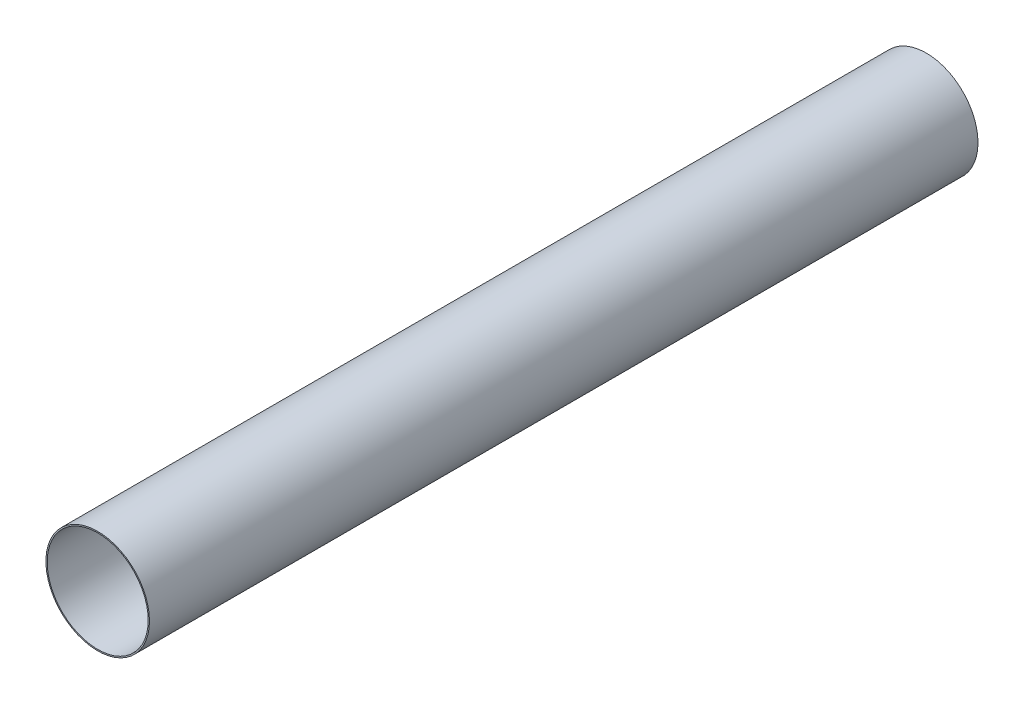
ISO-10303-21;
HEADER;
FILE_DESCRIPTION(('STEP AP214'),'2;1');
FILE_NAME('part.step','',(''),(''),'','','');
FILE_SCHEMA(('AUTOMOTIVE_DESIGN { 1 0 10303 214 1 1 1 1 }'));
ENDSEC;
DATA;
#1=APPLICATION_CONTEXT('core data for automotive mechanical design processes');
#2=APPLICATION_PROTOCOL_DEFINITION('international standard','automotive_design',2000,#1);
#3=PRODUCT_CONTEXT('',#1,'mechanical');
#4=PRODUCT('Part','Part','',(#3));
#5=PRODUCT_RELATED_PRODUCT_CATEGORY('part','',(#4));
#6=PRODUCT_DEFINITION_FORMATION('','',#4);
#7=PRODUCT_DEFINITION_CONTEXT('part definition',#1,'design');
#8=PRODUCT_DEFINITION('design','',#6,#7);
#9=PRODUCT_DEFINITION_SHAPE('','',#8);
#10=(LENGTH_UNIT() NAMED_UNIT(*) SI_UNIT(.MILLI.,.METRE.));
#11=(NAMED_UNIT(*) PLANE_ANGLE_UNIT() SI_UNIT($,.RADIAN.));
#12=(NAMED_UNIT(*) SI_UNIT($,.STERADIAN.) SOLID_ANGLE_UNIT());
#13=UNCERTAINTY_MEASURE_WITH_UNIT(LENGTH_MEASURE(1.E-05),#10,'distance_accuracy_value','');
#14=(GEOMETRIC_REPRESENTATION_CONTEXT(3) GLOBAL_UNCERTAINTY_ASSIGNED_CONTEXT((#13)) GLOBAL_UNIT_ASSIGNED_CONTEXT((#10,
#11,#12)) REPRESENTATION_CONTEXT('',''));
#15=CARTESIAN_POINT('',(0.,0.,0.));
#16=DIRECTION('',(0.,0.,1.));
#17=DIRECTION('',(1.,0.,0.));
#18=AXIS2_PLACEMENT_3D('',#15,#16,#17);
#19=CARTESIAN_POINT('',(0.,0.,330.2));
#20=DIRECTION('',(0.,0.,1.));
#21=DIRECTION('',(1.,0.,0.));
#22=AXIS2_PLACEMENT_3D('',#19,#20,#21);
#23=PLANE('',#22);
#24=CARTESIAN_POINT('',(0.,0.,330.2));
#25=DIRECTION('',(0.,0.,1.));
#26=DIRECTION('',(1.,0.,0.));
#27=AXIS2_PLACEMENT_3D('',#24,#25,#26);
#28=CIRCLE('',#27,20.6375);
#29=CARTESIAN_POINT('',(20.6375,0.,330.2));
#30=VERTEX_POINT('',#29);
#31=EDGE_CURVE('E10',#30,#30,#28,.T.);
#32=ORIENTED_EDGE('',*,*,#31,.T.);
#33=EDGE_LOOP('',(#32));
#34=FACE_BOUND('',#33,.T.);
#35=CARTESIAN_POINT('',(0.,0.,330.2));
#36=DIRECTION('',(0.,0.,1.));
#37=DIRECTION('',(1.,0.,0.));
#38=AXIS2_PLACEMENT_3D('',#35,#36,#37);
#39=CIRCLE('',#38,20.1295);
#40=CARTESIAN_POINT('',(20.1295,0.,330.2));
#41=VERTEX_POINT('',#40);
#42=EDGE_CURVE('E45',#41,#41,#39,.T.);
#43=ORIENTED_EDGE('',*,*,#42,.F.);
#44=EDGE_LOOP('',(#43));
#45=FACE_BOUND('',#44,.T.);
#46=ADVANCED_FACE('F34',(#34,#45),#23,.T.);
#47=CARTESIAN_POINT('',(0.,0.,0.));
#48=DIRECTION('',(0.,0.,1.));
#49=DIRECTION('',(1.,0.,0.));
#50=AXIS2_PLACEMENT_3D('',#47,#48,#49);
#51=PLANE('',#50);
#52=CARTESIAN_POINT('',(0.,0.,0.));
#53=DIRECTION('',(0.,0.,1.));
#54=DIRECTION('',(1.,0.,0.));
#55=AXIS2_PLACEMENT_3D('',#52,#53,#54);
#56=CIRCLE('',#55,20.6375);
#57=CARTESIAN_POINT('',(20.6375,0.,0.));
#58=VERTEX_POINT('',#57);
#59=EDGE_CURVE('E38',#58,#58,#56,.T.);
#60=ORIENTED_EDGE('',*,*,#59,.F.);
#61=EDGE_LOOP('',(#60));
#62=FACE_BOUND('',#61,.T.);
#63=CARTESIAN_POINT('',(0.,0.,0.));
#64=DIRECTION('',(0.,0.,1.));
#65=DIRECTION('',(1.,0.,0.));
#66=AXIS2_PLACEMENT_3D('',#63,#64,#65);
#67=CIRCLE('',#66,20.1295);
#68=CARTESIAN_POINT('',(20.1295,0.,0.));
#69=VERTEX_POINT('',#68);
#70=EDGE_CURVE('E47',#69,#69,#67,.T.);
#71=ORIENTED_EDGE('',*,*,#70,.T.);
#72=EDGE_LOOP('',(#71));
#73=FACE_BOUND('',#72,.T.);
#74=ADVANCED_FACE('F57',(#62,#73),#51,.F.);
#75=CARTESIAN_POINT('',(0.,0.,330.2));
#76=DIRECTION('',(0.,0.,-1.));
#77=DIRECTION('',(-1.,0.,0.));
#78=AXIS2_PLACEMENT_3D('',#75,#76,#77);
#79=CYLINDRICAL_SURFACE('',#78,20.6375);
#80=ORIENTED_EDGE('',*,*,#31,.F.);
#81=EDGE_LOOP('',(#80));
#82=FACE_BOUND('',#81,.T.);
#83=ORIENTED_EDGE('',*,*,#59,.T.);
#84=EDGE_LOOP('',(#83));
#85=FACE_BOUND('',#84,.T.);
#86=ADVANCED_FACE('F36',(#82,#85),#79,.T.);
#87=CARTESIAN_POINT('',(0.,0.,330.2));
#88=DIRECTION('',(0.,0.,-1.));
#89=DIRECTION('',(-1.,0.,0.));
#90=AXIS2_PLACEMENT_3D('',#87,#88,#89);
#91=CYLINDRICAL_SURFACE('',#90,20.1295);
#92=ORIENTED_EDGE('',*,*,#42,.T.);
#93=EDGE_LOOP('',(#92));
#94=FACE_BOUND('',#93,.T.);
#95=ORIENTED_EDGE('',*,*,#70,.F.);
#96=EDGE_LOOP('',(#95));
#97=FACE_BOUND('',#96,.T.);
#98=ADVANCED_FACE('F53',(#94,#97),#91,.F.);
#99=CLOSED_SHELL('',(#46,#74,#86,#98));
#100=MANIFOLD_SOLID_BREP('B2',#99);
#101=ADVANCED_BREP_SHAPE_REPRESENTATION('',(#18,#100),#14);
#102=SHAPE_DEFINITION_REPRESENTATION(#9,#101);
ENDSEC;
END-ISO-10303-21;
